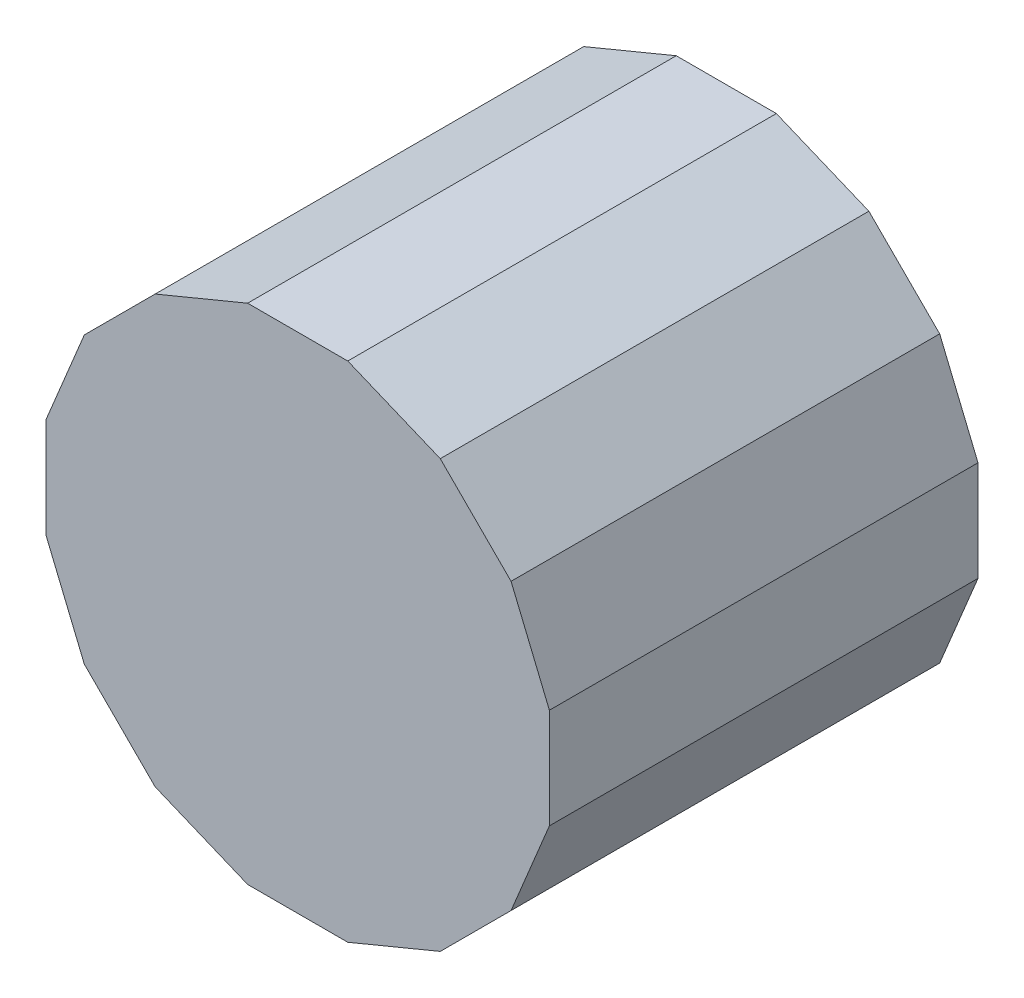
ISO-10303-21;
HEADER;
FILE_DESCRIPTION(('STEP AP214'),'2;1');
FILE_NAME('part.step','',(''),(''),'','','');
FILE_SCHEMA(('AUTOMOTIVE_DESIGN { 1 0 10303 214 1 1 1 1 }'));
ENDSEC;
DATA;
#1=APPLICATION_CONTEXT('core data for automotive mechanical design processes');
#2=APPLICATION_PROTOCOL_DEFINITION('international standard','automotive_design',2000,#1);
#3=PRODUCT_CONTEXT('',#1,'mechanical');
#4=PRODUCT('Part','Part','',(#3));
#5=PRODUCT_RELATED_PRODUCT_CATEGORY('part','',(#4));
#6=PRODUCT_DEFINITION_FORMATION('','',#4);
#7=PRODUCT_DEFINITION_CONTEXT('part definition',#1,'design');
#8=PRODUCT_DEFINITION('design','',#6,#7);
#9=PRODUCT_DEFINITION_SHAPE('','',#8);
#10=(LENGTH_UNIT() NAMED_UNIT(*) SI_UNIT(.MILLI.,.METRE.));
#11=(NAMED_UNIT(*) PLANE_ANGLE_UNIT() SI_UNIT($,.RADIAN.));
#12=(NAMED_UNIT(*) SI_UNIT($,.STERADIAN.) SOLID_ANGLE_UNIT());
#13=UNCERTAINTY_MEASURE_WITH_UNIT(LENGTH_MEASURE(1.E-05),#10,'distance_accuracy_value','');
#14=(GEOMETRIC_REPRESENTATION_CONTEXT(3) GLOBAL_UNCERTAINTY_ASSIGNED_CONTEXT((#13)) GLOBAL_UNIT_ASSIGNED_CONTEXT((#10,
#11,#12)) REPRESENTATION_CONTEXT('',''));
#15=CARTESIAN_POINT('',(0.,0.,0.));
#16=DIRECTION('',(0.,0.,1.));
#17=DIRECTION('',(1.,0.,0.));
#18=AXIS2_PLACEMENT_3D('',#15,#16,#17);
#19=CARTESIAN_POINT('',(-6.703377307555E-07,-6.703377397221E-07,0.51000152));
#20=DIRECTION('',(0.,0.,-1.));
#21=DIRECTION('',(-1.,0.,0.));
#22=AXIS2_PLACEMENT_3D('',#19,#20,#21);
#23=PLANE('',#22);
#24=DIRECTION('',(-0.923877822704835,-0.382687560176932,0.));
#25=VECTOR('',#24,1.);
#26=CARTESIAN_POINT('',(-0.16964914,0.25389586,0.51000152));
#27=LINE('',#26,#25);
#28=CARTESIAN_POINT('',(-0.16964914,0.25389586,0.51000152));
#29=VERTEX_POINT('',#28);
#30=CARTESIAN_POINT('',(-0.0595731600000064,0.299491400000015,0.51000152));
#31=VERTEX_POINT('',#30);
#32=EDGE_CURVE('E157',#29,#31,#27,.F.);
#33=ORIENTED_EDGE('',*,*,#32,.F.);
#34=DIRECTION('',(-0.707106781186548,-0.707106781186548,0.));
#35=VECTOR('',#34,1.);
#36=CARTESIAN_POINT('',(-0.2538984,0.1696466,0.51000152));
#37=LINE('',#36,#35);
#38=CARTESIAN_POINT('',(-0.253898399999996,0.169646599999998,0.51000152));
#39=VERTEX_POINT('',#38);
#40=EDGE_CURVE('E162',#39,#29,#37,.F.);
#41=ORIENTED_EDGE('',*,*,#40,.F.);
#42=DIRECTION('',(-0.382669363583049,-0.923885359866117,0.));
#43=VECTOR('',#42,1.);
#44=CARTESIAN_POINT('',(-0.2994914,0.05957061999999,0.51000152));
#45=LINE('',#44,#43);
#46=CARTESIAN_POINT('',(-0.2994914,0.05957061999999,0.51000152));
#47=VERTEX_POINT('',#46);
#48=EDGE_CURVE('E167',#47,#39,#45,.F.);
#49=ORIENTED_EDGE('',*,*,#48,.F.);
#50=DIRECTION('',(0.,1.,0.));
#51=VECTOR('',#50,1.);
#52=CARTESIAN_POINT('',(-0.2994914,0.,0.51000152));
#53=LINE('',#52,#51);
#54=CARTESIAN_POINT('',(-0.2994914,-0.0595731600000101,0.51000152));
#55=VERTEX_POINT('',#54);
#56=EDGE_CURVE('E172',#55,#47,#53,.T.);
#57=ORIENTED_EDGE('',*,*,#56,.F.);
#58=DIRECTION('',(0.382669363583049,-0.923885359866117,0.));
#59=VECTOR('',#58,1.);
#60=CARTESIAN_POINT('',(-0.2538984,-0.16964914,0.51000152));
#61=LINE('',#60,#59);
#62=CARTESIAN_POINT('',(-0.2538984,-0.16964914,0.51000152));
#63=VERTEX_POINT('',#62);
#64=EDGE_CURVE('E177',#63,#55,#61,.F.);
#65=ORIENTED_EDGE('',*,*,#64,.F.);
#66=DIRECTION('',(0.707106781186548,-0.707106781186548,0.));
#67=VECTOR('',#66,1.);
#68=CARTESIAN_POINT('',(-0.16964914,-0.2538984,0.51000152));
#69=LINE('',#68,#67);
#70=CARTESIAN_POINT('',(-0.169649139999999,-0.253898399999998,0.51000152));
#71=VERTEX_POINT('',#70);
#72=EDGE_CURVE('E183',#71,#63,#69,.F.);
#73=ORIENTED_EDGE('',*,*,#72,.F.);
#74=DIRECTION('',(0.923885359866117,-0.382669363583049,0.));
#75=VECTOR('',#74,1.);
#76=CARTESIAN_POINT('',(-0.05957316,-0.2994914,0.51000152));
#77=LINE('',#76,#75);
#78=CARTESIAN_POINT('',(-0.05957316,-0.2994914,0.51000152));
#79=VERTEX_POINT('',#78);
#80=EDGE_CURVE('E188',#79,#71,#77,.F.);
#81=ORIENTED_EDGE('',*,*,#80,.F.);
#82=DIRECTION('',(1.,0.,0.));
#83=VECTOR('',#82,1.);
#84=CARTESIAN_POINT('',(0.,-0.2994914,0.51000152));
#85=LINE('',#84,#83);
#86=CARTESIAN_POINT('',(0.0595706200000009,-0.299491400000002,0.51000152));
#87=VERTEX_POINT('',#86);
#88=EDGE_CURVE('E193',#87,#79,#85,.F.);
#89=ORIENTED_EDGE('',*,*,#88,.F.);
#90=DIRECTION('',(0.923885359866117,0.382669363583049,0.));
#91=VECTOR('',#90,1.);
#92=CARTESIAN_POINT('',(0.1696466,-0.2538984,0.51000152));
#93=LINE('',#92,#91);
#94=CARTESIAN_POINT('',(0.1696466,-0.2538984,0.51000152));
#95=VERTEX_POINT('',#94);
#96=EDGE_CURVE('E198',#95,#87,#93,.F.);
#97=ORIENTED_EDGE('',*,*,#96,.F.);
#98=DIRECTION('',(0.707106781186548,0.707106781186548,0.));
#99=VECTOR('',#98,1.);
#100=CARTESIAN_POINT('',(0.25389586,-0.16964914,0.51000152));
#101=LINE('',#100,#99);
#102=CARTESIAN_POINT('',(0.253895859999986,-0.169649139999994,0.51000152));
#103=VERTEX_POINT('',#102);
#104=EDGE_CURVE('E204',#103,#95,#101,.F.);
#105=ORIENTED_EDGE('',*,*,#104,.F.);
#106=DIRECTION('',(0.382687560176932,0.923877822704835,0.));
#107=VECTOR('',#106,1.);
#108=CARTESIAN_POINT('',(0.2994914,-0.05957316000001,0.51000152));
#109=LINE('',#108,#107);
#110=CARTESIAN_POINT('',(0.2994914,-0.05957316000001,0.51000152));
#111=VERTEX_POINT('',#110);
#112=EDGE_CURVE('E209',#111,#103,#109,.F.);
#113=ORIENTED_EDGE('',*,*,#112,.F.);
#114=DIRECTION('',(0.,1.,0.));
#115=VECTOR('',#114,1.);
#116=CARTESIAN_POINT('',(0.2994914,0.,0.51000152));
#117=LINE('',#116,#115);
#118=CARTESIAN_POINT('',(0.299491400000017,0.0595706199999972,0.51000152));
#119=VERTEX_POINT('',#118);
#120=EDGE_CURVE('E214',#119,#111,#117,.F.);
#121=ORIENTED_EDGE('',*,*,#120,.F.);
#122=DIRECTION('',(-0.382687560176932,0.923877822704835,0.));
#123=VECTOR('',#122,1.);
#124=CARTESIAN_POINT('',(0.25389586,0.1696466,0.51000152));
#125=LINE('',#124,#123);
#126=CARTESIAN_POINT('',(0.25389586,0.1696466,0.51000152));
#127=VERTEX_POINT('',#126);
#128=EDGE_CURVE('E219',#127,#119,#125,.F.);
#129=ORIENTED_EDGE('',*,*,#128,.F.);
#130=DIRECTION('',(-0.707106781186548,0.707106781186548,0.));
#131=VECTOR('',#130,1.);
#132=CARTESIAN_POINT('',(0.1696466,0.25389586,0.51000152));
#133=LINE('',#132,#131);
#134=CARTESIAN_POINT('',(0.169646599999994,0.253895859999984,0.51000152));
#135=VERTEX_POINT('',#134);
#136=EDGE_CURVE('E139',#135,#127,#133,.F.);
#137=ORIENTED_EDGE('',*,*,#136,.F.);
#138=DIRECTION('',(-0.923877822704835,0.382687560176932,0.));
#139=VECTOR('',#138,1.);
#140=CARTESIAN_POINT('',(0.05957062,0.2994914,0.51000152));
#141=LINE('',#140,#139);
#142=CARTESIAN_POINT('',(0.05957062,0.2994914,0.51000152));
#143=VERTEX_POINT('',#142);
#144=EDGE_CURVE('E127',#143,#135,#141,.F.);
#145=ORIENTED_EDGE('',*,*,#144,.F.);
#146=DIRECTION('',(1.,0.,0.));
#147=VECTOR('',#146,1.);
#148=CARTESIAN_POINT('',(-0.05957316,0.2994914,0.51000152));
#149=LINE('',#148,#147);
#150=EDGE_CURVE('E131',#31,#143,#149,.T.);
#151=ORIENTED_EDGE('',*,*,#150,.F.);
#152=EDGE_LOOP('',(#33,#41,#49,#57,#65,#73,#81,#89,#97,#105,#113,#121,#129,#137,#145,#151));
#153=FACE_BOUND('',#152,.T.);
#154=ADVANCED_FACE('F17',(#153),#23,.F.);
#155=CARTESIAN_POINT('',(0.05957062,0.2994914,0.));
#156=DIRECTION('',(0.382687560176932,0.923877822704835,0.));
#157=DIRECTION('',(-0.923877822704835,0.382687560176932,0.));
#158=AXIS2_PLACEMENT_3D('',#155,#156,#157);
#159=PLANE('',#158);
#160=DIRECTION('',(0.,0.,1.));
#161=VECTOR('',#160,1.);
#162=CARTESIAN_POINT('',(0.1696466,0.25389586,0.));
#163=LINE('',#162,#161);
#164=CARTESIAN_POINT('',(0.169646599999994,0.253895859999984,0.));
#165=VERTEX_POINT('',#164);
#166=EDGE_CURVE('E141',#165,#135,#163,.T.);
#167=ORIENTED_EDGE('',*,*,#166,.F.);
#168=DIRECTION('',(0.923877822704943,-0.382687560176672,0.));
#169=VECTOR('',#168,1.);
#170=CARTESIAN_POINT('',(0.05957062,0.2994914,0.));
#171=LINE('',#170,#169);
#172=CARTESIAN_POINT('',(0.05957062,0.2994914,0.));
#173=VERTEX_POINT('',#172);
#174=EDGE_CURVE('E144',#173,#165,#171,.T.);
#175=ORIENTED_EDGE('',*,*,#174,.F.);
#176=DIRECTION('',(0.,0.,1.));
#177=VECTOR('',#176,1.);
#178=CARTESIAN_POINT('',(0.05957062,0.2994914,0.));
#179=LINE('',#178,#177);
#180=EDGE_CURVE('E20',#173,#143,#179,.T.);
#181=ORIENTED_EDGE('',*,*,#180,.T.);
#182=ORIENTED_EDGE('',*,*,#144,.T.);
#183=EDGE_LOOP('',(#167,#175,#181,#182));
#184=FACE_BOUND('',#183,.T.);
#185=ADVANCED_FACE('F142',(#184),#159,.T.);
#186=CARTESIAN_POINT('',(0.1696466,0.25389586,0.));
#187=DIRECTION('',(0.707106781186548,0.707106781186548,0.));
#188=DIRECTION('',(-0.707106781186548,0.707106781186548,0.));
#189=AXIS2_PLACEMENT_3D('',#186,#187,#188);
#190=PLANE('',#189);
#191=DIRECTION('',(0.,0.,1.));
#192=VECTOR('',#191,1.);
#193=CARTESIAN_POINT('',(0.25389586,0.1696466,0.));
#194=LINE('',#193,#192);
#195=CARTESIAN_POINT('',(0.25389586,0.1696466,0.));
#196=VERTEX_POINT('',#195);
#197=EDGE_CURVE('E222',#196,#127,#194,.T.);
#198=ORIENTED_EDGE('',*,*,#197,.F.);
#199=DIRECTION('',(0.707106781186547,-0.707106781186547,0.));
#200=VECTOR('',#199,1.);
#201=CARTESIAN_POINT('',(0.1696466,0.25389586,0.));
#202=LINE('',#201,#200);
#203=EDGE_CURVE('E148',#165,#196,#202,.T.);
#204=ORIENTED_EDGE('',*,*,#203,.F.);
#205=ORIENTED_EDGE('',*,*,#166,.T.);
#206=ORIENTED_EDGE('',*,*,#136,.T.);
#207=EDGE_LOOP('',(#198,#204,#205,#206));
#208=FACE_BOUND('',#207,.T.);
#209=ADVANCED_FACE('F227',(#208),#190,.T.);
#210=CARTESIAN_POINT('',(0.25389586,0.1696466,0.));
#211=DIRECTION('',(0.923877822704835,0.382687560176932,0.));
#212=DIRECTION('',(-0.382687560176932,0.923877822704835,0.));
#213=AXIS2_PLACEMENT_3D('',#210,#211,#212);
#214=PLANE('',#213);
#215=DIRECTION('',(0.,0.,-1.));
#216=VECTOR('',#215,1.);
#217=CARTESIAN_POINT('',(0.2994914,0.05957061999999,0.));
#218=LINE('',#217,#216);
#219=CARTESIAN_POINT('',(0.299491400000017,0.0595706199999971,0.));
#220=VERTEX_POINT('',#219);
#221=EDGE_CURVE('E216',#220,#119,#218,.F.);
#222=ORIENTED_EDGE('',*,*,#221,.F.);
#223=DIRECTION('',(0.382687560176642,-0.923877822704955,0.));
#224=VECTOR('',#223,1.);
#225=CARTESIAN_POINT('',(0.25389586,0.1696466,0.));
#226=LINE('',#225,#224);
#227=EDGE_CURVE('E230',#196,#220,#226,.T.);
#228=ORIENTED_EDGE('',*,*,#227,.F.);
#229=ORIENTED_EDGE('',*,*,#197,.T.);
#230=ORIENTED_EDGE('',*,*,#128,.T.);
#231=EDGE_LOOP('',(#222,#228,#229,#230));
#232=FACE_BOUND('',#231,.T.);
#233=ADVANCED_FACE('F307',(#232),#214,.T.);
#234=CARTESIAN_POINT('',(0.2994914,0.,0.));
#235=DIRECTION('',(1.,0.,0.));
#236=DIRECTION('',(0.,0.,-1.));
#237=AXIS2_PLACEMENT_3D('',#234,#235,#236);
#238=PLANE('',#237);
#239=DIRECTION('',(0.,0.,1.));
#240=VECTOR('',#239,1.);
#241=CARTESIAN_POINT('',(0.2994914,-0.05957316000001,0.));
#242=LINE('',#241,#240);
#243=CARTESIAN_POINT('',(0.2994914,-0.05957316000001,0.));
#244=VERTEX_POINT('',#243);
#245=EDGE_CURVE('E211',#244,#111,#242,.T.);
#246=ORIENTED_EDGE('',*,*,#245,.F.);
#247=DIRECTION('',(0.,1.,0.));
#248=VECTOR('',#247,1.);
#249=CARTESIAN_POINT('',(0.2994914,-6.703377397221E-07,0.));
#250=LINE('',#249,#248);
#251=EDGE_CURVE('E231',#220,#244,#250,.F.);
#252=ORIENTED_EDGE('',*,*,#251,.F.);
#253=ORIENTED_EDGE('',*,*,#221,.T.);
#254=ORIENTED_EDGE('',*,*,#120,.T.);
#255=EDGE_LOOP('',(#246,#252,#253,#254));
#256=FACE_BOUND('',#255,.T.);
#257=ADVANCED_FACE('F305',(#256),#238,.T.);
#258=CARTESIAN_POINT('',(0.2994914,-0.05957316000001,0.));
#259=DIRECTION('',(0.923877822704835,-0.382687560176932,0.));
#260=DIRECTION('',(0.382687560176932,0.923877822704835,0.));
#261=AXIS2_PLACEMENT_3D('',#258,#259,#260);
#262=PLANE('',#261);
#263=DIRECTION('',(0.,0.,1.));
#264=VECTOR('',#263,1.);
#265=CARTESIAN_POINT('',(0.25389586,-0.16964914,0.));
#266=LINE('',#265,#264);
#267=CARTESIAN_POINT('',(0.253895859999986,-0.169649139999994,0.));
#268=VERTEX_POINT('',#267);
#269=EDGE_CURVE('E206',#268,#103,#266,.T.);
#270=ORIENTED_EDGE('',*,*,#269,.F.);
#271=DIRECTION('',(-0.382687560176702,-0.923877822704931,0.));
#272=VECTOR('',#271,1.);
#273=CARTESIAN_POINT('',(0.2994914,-0.05957316000001,0.));
#274=LINE('',#273,#272);
#275=EDGE_CURVE('E235',#244,#268,#274,.T.);
#276=ORIENTED_EDGE('',*,*,#275,.F.);
#277=ORIENTED_EDGE('',*,*,#245,.T.);
#278=ORIENTED_EDGE('',*,*,#112,.T.);
#279=EDGE_LOOP('',(#270,#276,#277,#278));
#280=FACE_BOUND('',#279,.T.);
#281=ADVANCED_FACE('F302',(#280),#262,.T.);
#282=CARTESIAN_POINT('',(0.25389586,-0.16964914,0.));
#283=DIRECTION('',(0.707106781186548,-0.707106781186548,0.));
#284=DIRECTION('',(0.707106781186548,0.707106781186548,0.));
#285=AXIS2_PLACEMENT_3D('',#282,#283,#284);
#286=PLANE('',#285);
#287=DIRECTION('',(0.,0.,1.));
#288=VECTOR('',#287,1.);
#289=CARTESIAN_POINT('',(0.1696466,-0.2538984,0.));
#290=LINE('',#289,#288);
#291=CARTESIAN_POINT('',(0.1696466,-0.2538984,0.));
#292=VERTEX_POINT('',#291);
#293=EDGE_CURVE('E201',#292,#95,#290,.T.);
#294=ORIENTED_EDGE('',*,*,#293,.F.);
#295=DIRECTION('',(-0.707106781186547,-0.707106781186548,0.));
#296=VECTOR('',#295,1.);
#297=CARTESIAN_POINT('',(0.25389586,-0.16964914,0.));
#298=LINE('',#297,#296);
#299=EDGE_CURVE('E238',#268,#292,#298,.T.);
#300=ORIENTED_EDGE('',*,*,#299,.F.);
#301=ORIENTED_EDGE('',*,*,#269,.T.);
#302=ORIENTED_EDGE('',*,*,#104,.T.);
#303=EDGE_LOOP('',(#294,#300,#301,#302));
#304=FACE_BOUND('',#303,.T.);
#305=ADVANCED_FACE('F297',(#304),#286,.T.);
#306=CARTESIAN_POINT('',(0.1696466,-0.2538984,0.));
#307=DIRECTION('',(0.382669363583049,-0.923885359866117,0.));
#308=DIRECTION('',(0.923885359866117,0.382669363583049,0.));
#309=AXIS2_PLACEMENT_3D('',#306,#307,#308);
#310=PLANE('',#309);
#311=DIRECTION('',(0.,0.,-1.));
#312=VECTOR('',#311,1.);
#313=CARTESIAN_POINT('',(0.05957062,-0.2994914,0.));
#314=LINE('',#313,#312);
#315=CARTESIAN_POINT('',(0.0595706200000009,-0.299491400000002,0.));
#316=VERTEX_POINT('',#315);
#317=EDGE_CURVE('E195',#316,#87,#314,.F.);
#318=ORIENTED_EDGE('',*,*,#317,.F.);
#319=DIRECTION('',(-0.923885359866132,-0.382669363583013,0.));
#320=VECTOR('',#319,1.);
#321=CARTESIAN_POINT('',(0.1696466,-0.2538984,0.));
#322=LINE('',#321,#320);
#323=EDGE_CURVE('E241',#292,#316,#322,.T.);
#324=ORIENTED_EDGE('',*,*,#323,.F.);
#325=ORIENTED_EDGE('',*,*,#293,.T.);
#326=ORIENTED_EDGE('',*,*,#96,.T.);
#327=EDGE_LOOP('',(#318,#324,#325,#326));
#328=FACE_BOUND('',#327,.T.);
#329=ADVANCED_FACE('F293',(#328),#310,.T.);
#330=CARTESIAN_POINT('',(0.,-0.2994914,0.));
#331=DIRECTION('',(0.,-1.,0.));
#332=DIRECTION('',(0.,0.,-1.));
#333=AXIS2_PLACEMENT_3D('',#330,#331,#332);
#334=PLANE('',#333);
#335=DIRECTION('',(0.,0.,1.));
#336=VECTOR('',#335,1.);
#337=CARTESIAN_POINT('',(-0.05957316,-0.2994914,0.));
#338=LINE('',#337,#336);
#339=CARTESIAN_POINT('',(-0.05957316,-0.2994914,0.));
#340=VERTEX_POINT('',#339);
#341=EDGE_CURVE('E190',#340,#79,#338,.T.);
#342=ORIENTED_EDGE('',*,*,#341,.F.);
#343=DIRECTION('',(-1.,0.,0.));
#344=VECTOR('',#343,1.);
#345=CARTESIAN_POINT('',(-6.703377307555E-07,-0.2994914,0.));
#346=LINE('',#345,#344);
#347=EDGE_CURVE('E244',#316,#340,#346,.T.);
#348=ORIENTED_EDGE('',*,*,#347,.F.);
#349=ORIENTED_EDGE('',*,*,#317,.T.);
#350=ORIENTED_EDGE('',*,*,#88,.T.);
#351=EDGE_LOOP('',(#342,#348,#349,#350));
#352=FACE_BOUND('',#351,.T.);
#353=ADVANCED_FACE('F289',(#352),#334,.T.);
#354=CARTESIAN_POINT('',(-0.05957316,-0.2994914,0.));
#355=DIRECTION('',(-0.382669363583049,-0.923885359866117,0.));
#356=DIRECTION('',(0.923885359866117,-0.382669363583049,0.));
#357=AXIS2_PLACEMENT_3D('',#354,#355,#356);
#358=PLANE('',#357);
#359=DIRECTION('',(0.,0.,1.));
#360=VECTOR('',#359,1.);
#361=CARTESIAN_POINT('',(-0.16964914,-0.2538984,0.));
#362=LINE('',#361,#360);
#363=CARTESIAN_POINT('',(-0.169649139999999,-0.253898399999998,0.));
#364=VERTEX_POINT('',#363);
#365=EDGE_CURVE('E185',#364,#71,#362,.T.);
#366=ORIENTED_EDGE('',*,*,#365,.F.);
#367=DIRECTION('',(-0.923885359866132,0.382669363583013,0.));
#368=VECTOR('',#367,1.);
#369=CARTESIAN_POINT('',(-0.05957316,-0.2994914,0.));
#370=LINE('',#369,#368);
#371=EDGE_CURVE('E246',#340,#364,#370,.T.);
#372=ORIENTED_EDGE('',*,*,#371,.F.);
#373=ORIENTED_EDGE('',*,*,#341,.T.);
#374=ORIENTED_EDGE('',*,*,#80,.T.);
#375=EDGE_LOOP('',(#366,#372,#373,#374));
#376=FACE_BOUND('',#375,.T.);
#377=ADVANCED_FACE('F285',(#376),#358,.T.);
#378=CARTESIAN_POINT('',(-0.16964914,-0.2538984,0.));
#379=DIRECTION('',(-0.707106781186548,-0.707106781186548,0.));
#380=DIRECTION('',(0.707106781186548,-0.707106781186548,0.));
#381=AXIS2_PLACEMENT_3D('',#378,#379,#380);
#382=PLANE('',#381);
#383=DIRECTION('',(0.,0.,1.));
#384=VECTOR('',#383,1.);
#385=CARTESIAN_POINT('',(-0.2538984,-0.16964914,0.));
#386=LINE('',#385,#384);
#387=CARTESIAN_POINT('',(-0.2538984,-0.16964914,0.));
#388=VERTEX_POINT('',#387);
#389=EDGE_CURVE('E180',#388,#63,#386,.T.);
#390=ORIENTED_EDGE('',*,*,#389,.F.);
#391=DIRECTION('',(-0.707106781186547,0.707106781186547,0.));
#392=VECTOR('',#391,1.);
#393=CARTESIAN_POINT('',(-0.16964914,-0.2538984,0.));
#394=LINE('',#393,#392);
#395=EDGE_CURVE('E249',#364,#388,#394,.T.);
#396=ORIENTED_EDGE('',*,*,#395,.F.);
#397=ORIENTED_EDGE('',*,*,#365,.T.);
#398=ORIENTED_EDGE('',*,*,#72,.T.);
#399=EDGE_LOOP('',(#390,#396,#397,#398));
#400=FACE_BOUND('',#399,.T.);
#401=ADVANCED_FACE('F282',(#400),#382,.T.);
#402=CARTESIAN_POINT('',(-0.2538984,-0.16964914,0.));
#403=DIRECTION('',(-0.923885359866117,-0.382669363583049,0.));
#404=DIRECTION('',(0.382669363583049,-0.923885359866117,0.));
#405=AXIS2_PLACEMENT_3D('',#402,#403,#404);
#406=PLANE('',#405);
#407=DIRECTION('',(0.,0.,1.));
#408=VECTOR('',#407,1.);
#409=CARTESIAN_POINT('',(-0.2994914,-0.05957316000001,0.));
#410=LINE('',#409,#408);
#411=CARTESIAN_POINT('',(-0.2994914,-0.0595731600000101,0.));
#412=VERTEX_POINT('',#411);
#413=EDGE_CURVE('E174',#412,#55,#410,.T.);
#414=ORIENTED_EDGE('',*,*,#413,.F.);
#415=DIRECTION('',(-0.382669363583043,0.923885359866119,0.));
#416=VECTOR('',#415,1.);
#417=CARTESIAN_POINT('',(-0.2538984,-0.16964914,0.));
#418=LINE('',#417,#416);
#419=EDGE_CURVE('E252',#388,#412,#418,.T.);
#420=ORIENTED_EDGE('',*,*,#419,.F.);
#421=ORIENTED_EDGE('',*,*,#389,.T.);
#422=ORIENTED_EDGE('',*,*,#64,.T.);
#423=EDGE_LOOP('',(#414,#420,#421,#422));
#424=FACE_BOUND('',#423,.T.);
#425=ADVANCED_FACE('F277',(#424),#406,.T.);
#426=CARTESIAN_POINT('',(-0.2994914,0.,0.));
#427=DIRECTION('',(-1.,0.,0.));
#428=DIRECTION('',(0.,0.,1.));
#429=AXIS2_PLACEMENT_3D('',#426,#427,#428);
#430=PLANE('',#429);
#431=DIRECTION('',(0.,0.,1.));
#432=VECTOR('',#431,1.);
#433=CARTESIAN_POINT('',(-0.2994914,0.05957061999999,0.));
#434=LINE('',#433,#432);
#435=CARTESIAN_POINT('',(-0.2994914,0.05957061999999,0.));
#436=VERTEX_POINT('',#435);
#437=EDGE_CURVE('E169',#436,#47,#434,.T.);
#438=ORIENTED_EDGE('',*,*,#437,.F.);
#439=DIRECTION('',(0.,1.,0.));
#440=VECTOR('',#439,1.);
#441=CARTESIAN_POINT('',(-0.2994914,-6.703377397221E-07,0.));
#442=LINE('',#441,#440);
#443=EDGE_CURVE('E255',#412,#436,#442,.T.);
#444=ORIENTED_EDGE('',*,*,#443,.F.);
#445=ORIENTED_EDGE('',*,*,#413,.T.);
#446=ORIENTED_EDGE('',*,*,#56,.T.);
#447=EDGE_LOOP('',(#438,#444,#445,#446));
#448=FACE_BOUND('',#447,.T.);
#449=ADVANCED_FACE('F274',(#448),#430,.T.);
#450=CARTESIAN_POINT('',(-0.2994914,0.05957061999999,0.));
#451=DIRECTION('',(-0.923885359866117,0.382669363583049,0.));
#452=DIRECTION('',(-0.382669363583049,-0.923885359866117,0.));
#453=AXIS2_PLACEMENT_3D('',#450,#451,#452);
#454=PLANE('',#453);
#455=DIRECTION('',(0.,0.,1.));
#456=VECTOR('',#455,1.);
#457=CARTESIAN_POINT('',(-0.2538984,0.1696466,0.));
#458=LINE('',#457,#456);
#459=CARTESIAN_POINT('',(-0.253898399999996,0.169646599999998,0.));
#460=VERTEX_POINT('',#459);
#461=EDGE_CURVE('E164',#460,#39,#458,.T.);
#462=ORIENTED_EDGE('',*,*,#461,.F.);
#463=DIRECTION('',(0.382669363582984,0.923885359866144,0.));
#464=VECTOR('',#463,1.);
#465=CARTESIAN_POINT('',(-0.2994914,0.05957061999999,0.));
#466=LINE('',#465,#464);
#467=EDGE_CURVE('E257',#436,#460,#466,.T.);
#468=ORIENTED_EDGE('',*,*,#467,.F.);
#469=ORIENTED_EDGE('',*,*,#437,.T.);
#470=ORIENTED_EDGE('',*,*,#48,.T.);
#471=EDGE_LOOP('',(#462,#468,#469,#470));
#472=FACE_BOUND('',#471,.T.);
#473=ADVANCED_FACE('F271',(#472),#454,.T.);
#474=CARTESIAN_POINT('',(-0.2538984,0.1696466,0.));
#475=DIRECTION('',(-0.707106781186548,0.707106781186548,0.));
#476=DIRECTION('',(-0.707106781186548,-0.707106781186548,0.));
#477=AXIS2_PLACEMENT_3D('',#474,#475,#476);
#478=PLANE('',#477);
#479=DIRECTION('',(0.,0.,1.));
#480=VECTOR('',#479,1.);
#481=CARTESIAN_POINT('',(-0.16964914,0.25389586,0.));
#482=LINE('',#481,#480);
#483=CARTESIAN_POINT('',(-0.16964914,0.25389586,0.));
#484=VERTEX_POINT('',#483);
#485=EDGE_CURVE('E159',#484,#29,#482,.T.);
#486=ORIENTED_EDGE('',*,*,#485,.F.);
#487=DIRECTION('',(0.707106781186548,0.707106781186547,0.));
#488=VECTOR('',#487,1.);
#489=CARTESIAN_POINT('',(-0.2538984,0.1696466,0.));
#490=LINE('',#489,#488);
#491=EDGE_CURVE('E26',#460,#484,#490,.T.);
#492=ORIENTED_EDGE('',*,*,#491,.F.);
#493=ORIENTED_EDGE('',*,*,#461,.T.);
#494=ORIENTED_EDGE('',*,*,#40,.T.);
#495=EDGE_LOOP('',(#486,#492,#493,#494));
#496=FACE_BOUND('',#495,.T.);
#497=ADVANCED_FACE('F263',(#496),#478,.T.);
#498=CARTESIAN_POINT('',(-0.16964914,0.25389586,0.));
#499=DIRECTION('',(-0.382687560176932,0.923877822704835,0.));
#500=DIRECTION('',(-0.923877822704835,-0.382687560176932,0.));
#501=AXIS2_PLACEMENT_3D('',#498,#499,#500);
#502=PLANE('',#501);
#503=DIRECTION('',(0.,0.,1.));
#504=VECTOR('',#503,1.);
#505=CARTESIAN_POINT('',(-0.05957316,0.2994914,0.));
#506=LINE('',#505,#504);
#507=CARTESIAN_POINT('',(-0.0595731600000064,0.299491400000015,0.));
#508=VERTEX_POINT('',#507);
#509=EDGE_CURVE('E134',#508,#31,#506,.T.);
#510=ORIENTED_EDGE('',*,*,#509,.F.);
#511=DIRECTION('',(0.923877822704943,0.382687560176672,0.));
#512=VECTOR('',#511,1.);
#513=CARTESIAN_POINT('',(-0.16964914,0.25389586,0.));
#514=LINE('',#513,#512);
#515=EDGE_CURVE('E11',#484,#508,#514,.T.);
#516=ORIENTED_EDGE('',*,*,#515,.F.);
#517=ORIENTED_EDGE('',*,*,#485,.T.);
#518=ORIENTED_EDGE('',*,*,#32,.T.);
#519=EDGE_LOOP('',(#510,#516,#517,#518));
#520=FACE_BOUND('',#519,.T.);
#521=ADVANCED_FACE('F266',(#520),#502,.T.);
#522=CARTESIAN_POINT('',(-0.05957316,0.2994914,0.));
#523=DIRECTION('',(0.,1.,0.));
#524=DIRECTION('',(0.,0.,1.));
#525=AXIS2_PLACEMENT_3D('',#522,#523,#524);
#526=PLANE('',#525);
#527=ORIENTED_EDGE('',*,*,#150,.T.);
#528=ORIENTED_EDGE('',*,*,#180,.F.);
#529=DIRECTION('',(-1.,0.,0.));
#530=VECTOR('',#529,1.);
#531=CARTESIAN_POINT('',(-6.703377307555E-07,0.2994914,0.));
#532=LINE('',#531,#530);
#533=EDGE_CURVE('E35',#508,#173,#532,.F.);
#534=ORIENTED_EDGE('',*,*,#533,.F.);
#535=ORIENTED_EDGE('',*,*,#509,.T.);
#536=EDGE_LOOP('',(#527,#528,#534,#535));
#537=FACE_BOUND('',#536,.T.);
#538=ADVANCED_FACE('F132',(#537),#526,.T.);
#539=CARTESIAN_POINT('',(-6.703377307555E-07,-6.703377397221E-07,0.));
#540=DIRECTION('',(0.,0.,-1.));
#541=DIRECTION('',(-1.,0.,0.));
#542=AXIS2_PLACEMENT_3D('',#539,#540,#541);
#543=PLANE('',#542);
#544=ORIENTED_EDGE('',*,*,#515,.T.);
#545=ORIENTED_EDGE('',*,*,#533,.T.);
#546=ORIENTED_EDGE('',*,*,#174,.T.);
#547=ORIENTED_EDGE('',*,*,#203,.T.);
#548=ORIENTED_EDGE('',*,*,#227,.T.);
#549=ORIENTED_EDGE('',*,*,#251,.T.);
#550=ORIENTED_EDGE('',*,*,#275,.T.);
#551=ORIENTED_EDGE('',*,*,#299,.T.);
#552=ORIENTED_EDGE('',*,*,#323,.T.);
#553=ORIENTED_EDGE('',*,*,#347,.T.);
#554=ORIENTED_EDGE('',*,*,#371,.T.);
#555=ORIENTED_EDGE('',*,*,#395,.T.);
#556=ORIENTED_EDGE('',*,*,#419,.T.);
#557=ORIENTED_EDGE('',*,*,#443,.T.);
#558=ORIENTED_EDGE('',*,*,#467,.T.);
#559=ORIENTED_EDGE('',*,*,#491,.T.);
#560=EDGE_LOOP('',(#544,#545,#546,#547,#548,#549,#550,#551,#552,#553,#554,#555,#556,#557,#558,#559));
#561=FACE_BOUND('',#560,.T.);
#562=ADVANCED_FACE('F150',(#561),#543,.T.);
#563=CLOSED_SHELL('',(#154,#185,#209,#233,#257,#281,#305,#329,#353,#377,#401,#425,#449,#473,
#497,#521,#538,#562));
#564=MANIFOLD_SOLID_BREP('B1',#563);
#565=ADVANCED_BREP_SHAPE_REPRESENTATION('',(#18,#564),#14);
#566=SHAPE_DEFINITION_REPRESENTATION(#9,#565);
ENDSEC;
END-ISO-10303-21;
